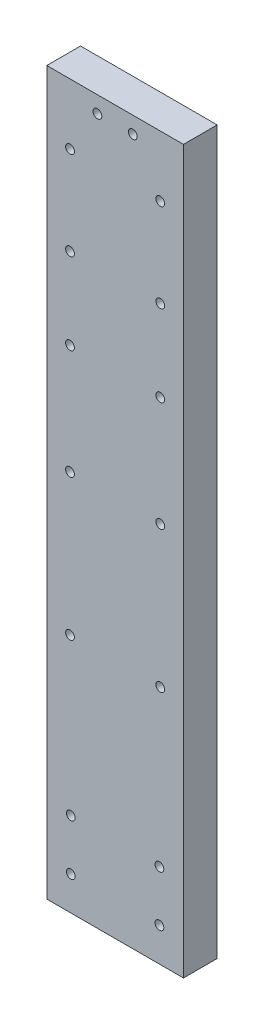
ISO-10303-21;
HEADER;
FILE_DESCRIPTION(('STEP AP214'),'2;1');
FILE_NAME('part.step','',(''),(''),'','','');
FILE_SCHEMA(('AUTOMOTIVE_DESIGN { 1 0 10303 214 1 1 1 1 }'));
ENDSEC;
DATA;
#1=APPLICATION_CONTEXT('core data for automotive mechanical design processes');
#2=APPLICATION_PROTOCOL_DEFINITION('international standard','automotive_design',2000,#1);
#3=PRODUCT_CONTEXT('',#1,'mechanical');
#4=PRODUCT('Part','Part','',(#3));
#5=PRODUCT_RELATED_PRODUCT_CATEGORY('part','',(#4));
#6=PRODUCT_DEFINITION_FORMATION('','',#4);
#7=PRODUCT_DEFINITION_CONTEXT('part definition',#1,'design');
#8=PRODUCT_DEFINITION('design','',#6,#7);
#9=PRODUCT_DEFINITION_SHAPE('','',#8);
#10=(LENGTH_UNIT() NAMED_UNIT(*) SI_UNIT(.MILLI.,.METRE.));
#11=(NAMED_UNIT(*) PLANE_ANGLE_UNIT() SI_UNIT($,.RADIAN.));
#12=(NAMED_UNIT(*) SI_UNIT($,.STERADIAN.) SOLID_ANGLE_UNIT());
#13=UNCERTAINTY_MEASURE_WITH_UNIT(LENGTH_MEASURE(1.E-05),#10,'distance_accuracy_value','');
#14=(GEOMETRIC_REPRESENTATION_CONTEXT(3) GLOBAL_UNCERTAINTY_ASSIGNED_CONTEXT((#13)) GLOBAL_UNIT_ASSIGNED_CONTEXT((#10,
#11,#12)) REPRESENTATION_CONTEXT('',''));
#15=CARTESIAN_POINT('',(0.,0.,0.));
#16=DIRECTION('',(0.,0.,1.));
#17=DIRECTION('',(1.,0.,0.));
#18=AXIS2_PLACEMENT_3D('',#15,#16,#17);
#19=CARTESIAN_POINT('',(0.,0.,4.));
#20=DIRECTION('',(0.,0.,-1.));
#21=DIRECTION('',(-1.,0.,0.));
#22=AXIS2_PLACEMENT_3D('',#19,#20,#21);
#23=PLANE('',#22);
#24=CARTESIAN_POINT('',(10.2,83.635,4.));
#25=DIRECTION('',(0.,0.,1.));
#26=DIRECTION('',(1.,0.,0.));
#27=AXIS2_PLACEMENT_3D('',#24,#25,#26);
#28=CIRCLE('',#27,0.519960121099865);
#29=CARTESIAN_POINT('',(10.7199601210999,83.635,4.));
#30=VERTEX_POINT('',#29);
#31=EDGE_CURVE('E193',#30,#30,#28,.T.);
#32=ORIENTED_EDGE('',*,*,#31,.F.);
#33=EDGE_LOOP('',(#32));
#34=FACE_BOUND('',#33,.T.);
#35=CARTESIAN_POINT('',(13.45,78.385,4.));
#36=DIRECTION('',(0.,0.,1.));
#37=DIRECTION('',(1.,0.,0.));
#38=AXIS2_PLACEMENT_3D('',#35,#36,#37);
#39=CIRCLE('',#38,0.519960121099864);
#40=CARTESIAN_POINT('',(13.9699601210999,78.385,4.));
#41=VERTEX_POINT('',#40);
#42=EDGE_CURVE('E181',#41,#41,#39,.T.);
#43=ORIENTED_EDGE('',*,*,#42,.F.);
#44=EDGE_LOOP('',(#43));
#45=FACE_BOUND('',#44,.T.);
#46=CARTESIAN_POINT('',(13.35,4.,4.));
#47=DIRECTION('',(0.,0.,1.));
#48=DIRECTION('',(-1.,0.,0.));
#49=AXIS2_PLACEMENT_3D('',#46,#47,#48);
#50=CIRCLE('',#49,0.519960121099866);
#51=CARTESIAN_POINT('',(12.8300398789001,4.,4.));
#52=VERTEX_POINT('',#51);
#53=EDGE_CURVE('E169',#52,#52,#50,.T.);
#54=ORIENTED_EDGE('',*,*,#53,.F.);
#55=EDGE_LOOP('',(#54));
#56=FACE_BOUND('',#55,.T.);
#57=CARTESIAN_POINT('',(2.85,4.,4.));
#58=DIRECTION('',(0.,0.,1.));
#59=DIRECTION('',(1.,0.,0.));
#60=AXIS2_PLACEMENT_3D('',#57,#58,#59);
#61=CIRCLE('',#60,0.519960121099866);
#62=CARTESIAN_POINT('',(3.36996012109987,4.,4.));
#63=VERTEX_POINT('',#62);
#64=EDGE_CURVE('E157',#63,#63,#61,.T.);
#65=ORIENTED_EDGE('',*,*,#64,.F.);
#66=EDGE_LOOP('',(#65));
#67=FACE_BOUND('',#66,.T.);
#68=CARTESIAN_POINT('',(13.45,67.885,4.));
#69=DIRECTION('',(0.,0.,1.));
#70=DIRECTION('',(1.,0.,0.));
#71=AXIS2_PLACEMENT_3D('',#68,#69,#70);
#72=CIRCLE('',#71,0.519960121099864);
#73=CARTESIAN_POINT('',(13.9699601210999,67.885,4.));
#74=VERTEX_POINT('',#73);
#75=EDGE_CURVE('E145',#74,#74,#72,.T.);
#76=ORIENTED_EDGE('',*,*,#75,.F.);
#77=EDGE_LOOP('',(#76));
#78=FACE_BOUND('',#77,.T.);
#79=CARTESIAN_POINT('',(13.45,58.24,4.));
#80=DIRECTION('',(0.,0.,1.));
#81=DIRECTION('',(1.,0.,0.));
#82=AXIS2_PLACEMENT_3D('',#79,#80,#81);
#83=CIRCLE('',#82,0.519960121099861);
#84=CARTESIAN_POINT('',(13.9699601210999,58.24,4.));
#85=VERTEX_POINT('',#84);
#86=EDGE_CURVE('E133',#85,#85,#83,.T.);
#87=ORIENTED_EDGE('',*,*,#86,.F.);
#88=EDGE_LOOP('',(#87));
#89=FACE_BOUND('',#88,.T.);
#90=CARTESIAN_POINT('',(13.45,45.24,4.));
#91=DIRECTION('',(0.,0.,1.));
#92=DIRECTION('',(1.,0.,0.));
#93=AXIS2_PLACEMENT_3D('',#90,#91,#92);
#94=CIRCLE('',#93,0.519960121099861);
#95=CARTESIAN_POINT('',(13.9699601210999,45.24,4.));
#96=VERTEX_POINT('',#95);
#97=EDGE_CURVE('E121',#96,#96,#94,.T.);
#98=ORIENTED_EDGE('',*,*,#97,.F.);
#99=EDGE_LOOP('',(#98));
#100=FACE_BOUND('',#99,.T.);
#101=CARTESIAN_POINT('',(13.45,28.5,4.));
#102=DIRECTION('',(0.,0.,1.));
#103=DIRECTION('',(1.,0.,0.));
#104=AXIS2_PLACEMENT_3D('',#101,#102,#103);
#105=CIRCLE('',#104,0.519960121099865);
#106=CARTESIAN_POINT('',(13.9699601210999,28.5,4.));
#107=VERTEX_POINT('',#106);
#108=EDGE_CURVE('E100',#107,#107,#105,.T.);
#109=ORIENTED_EDGE('',*,*,#108,.F.);
#110=EDGE_LOOP('',(#109));
#111=FACE_BOUND('',#110,.T.);
#112=DIRECTION('',(-1.,0.,0.));
#113=VECTOR('',#112,1.);
#114=CARTESIAN_POINT('',(16.2,85.59,4.));
#115=LINE('',#114,#113);
#116=CARTESIAN_POINT('',(16.2,85.59,4.));
#117=VERTEX_POINT('',#116);
#118=CARTESIAN_POINT('',(0.,85.59,4.));
#119=VERTEX_POINT('',#118);
#120=EDGE_CURVE('E85',#117,#119,#115,.T.);
#121=ORIENTED_EDGE('',*,*,#120,.T.);
#122=DIRECTION('',(0.,-1.,0.));
#123=VECTOR('',#122,1.);
#124=CARTESIAN_POINT('',(0.,0.,4.));
#125=LINE('',#124,#123);
#126=CARTESIAN_POINT('',(0.,0.,4.));
#127=VERTEX_POINT('',#126);
#128=EDGE_CURVE('E80',#119,#127,#125,.T.);
#129=ORIENTED_EDGE('',*,*,#128,.T.);
#130=DIRECTION('',(1.,0.,0.));
#131=VECTOR('',#130,1.);
#132=CARTESIAN_POINT('',(0.,0.,4.));
#133=LINE('',#132,#131);
#134=CARTESIAN_POINT('',(16.2,0.,4.));
#135=VERTEX_POINT('',#134);
#136=EDGE_CURVE('E83',#127,#135,#133,.T.);
#137=ORIENTED_EDGE('',*,*,#136,.T.);
#138=DIRECTION('',(0.,1.,0.));
#139=VECTOR('',#138,1.);
#140=CARTESIAN_POINT('',(16.2,0.,4.));
#141=LINE('',#140,#139);
#142=EDGE_CURVE('E50',#135,#117,#141,.T.);
#143=ORIENTED_EDGE('',*,*,#142,.T.);
#144=EDGE_LOOP('',(#121,#129,#137,#143));
#145=FACE_BOUND('',#144,.T.);
#146=CARTESIAN_POINT('',(2.75,28.5,4.));
#147=DIRECTION('',(0.,0.,1.));
#148=DIRECTION('',(1.,0.,0.));
#149=AXIS2_PLACEMENT_3D('',#146,#147,#148);
#150=CIRCLE('',#149,0.519960121099867);
#151=CARTESIAN_POINT('',(3.26996012109987,28.5,4.));
#152=VERTEX_POINT('',#151);
#153=EDGE_CURVE('E115',#152,#152,#150,.T.);
#154=ORIENTED_EDGE('',*,*,#153,.F.);
#155=EDGE_LOOP('',(#154));
#156=FACE_BOUND('',#155,.T.);
#157=CARTESIAN_POINT('',(2.75,45.24,4.));
#158=DIRECTION('',(0.,0.,1.));
#159=DIRECTION('',(1.,0.,0.));
#160=AXIS2_PLACEMENT_3D('',#157,#158,#159);
#161=CIRCLE('',#160,0.519960121099859);
#162=CARTESIAN_POINT('',(3.26996012109986,45.24,4.));
#163=VERTEX_POINT('',#162);
#164=EDGE_CURVE('E127',#163,#163,#161,.T.);
#165=ORIENTED_EDGE('',*,*,#164,.F.);
#166=EDGE_LOOP('',(#165));
#167=FACE_BOUND('',#166,.T.);
#168=CARTESIAN_POINT('',(2.75,58.24,4.));
#169=DIRECTION('',(0.,0.,1.));
#170=DIRECTION('',(1.,0.,0.));
#171=AXIS2_PLACEMENT_3D('',#168,#169,#170);
#172=CIRCLE('',#171,0.51996012109986);
#173=CARTESIAN_POINT('',(3.26996012109986,58.24,4.));
#174=VERTEX_POINT('',#173);
#175=EDGE_CURVE('E139',#174,#174,#172,.T.);
#176=ORIENTED_EDGE('',*,*,#175,.F.);
#177=EDGE_LOOP('',(#176));
#178=FACE_BOUND('',#177,.T.);
#179=CARTESIAN_POINT('',(2.85,10.,4.));
#180=DIRECTION('',(0.,0.,1.));
#181=DIRECTION('',(1.,0.,0.));
#182=AXIS2_PLACEMENT_3D('',#179,#180,#181);
#183=CIRCLE('',#182,0.519960121099866);
#184=CARTESIAN_POINT('',(3.36996012109986,10.,4.));
#185=VERTEX_POINT('',#184);
#186=EDGE_CURVE('E151',#185,#185,#183,.T.);
#187=ORIENTED_EDGE('',*,*,#186,.F.);
#188=EDGE_LOOP('',(#187));
#189=FACE_BOUND('',#188,.T.);
#190=CARTESIAN_POINT('',(13.35,10.,4.));
#191=DIRECTION('',(0.,0.,1.));
#192=DIRECTION('',(-1.,0.,0.));
#193=AXIS2_PLACEMENT_3D('',#190,#191,#192);
#194=CIRCLE('',#193,0.519960121099863);
#195=CARTESIAN_POINT('',(12.8300398789001,10.,4.));
#196=VERTEX_POINT('',#195);
#197=EDGE_CURVE('E163',#196,#196,#194,.T.);
#198=ORIENTED_EDGE('',*,*,#197,.F.);
#199=EDGE_LOOP('',(#198));
#200=FACE_BOUND('',#199,.T.);
#201=CARTESIAN_POINT('',(2.74999999999862,67.885,4.));
#202=DIRECTION('',(0.,0.,1.));
#203=DIRECTION('',(1.,0.,0.));
#204=AXIS2_PLACEMENT_3D('',#201,#202,#203);
#205=CIRCLE('',#204,0.519960121099858);
#206=CARTESIAN_POINT('',(3.26996012109847,67.885,4.));
#207=VERTEX_POINT('',#206);
#208=EDGE_CURVE('E175',#207,#207,#205,.T.);
#209=ORIENTED_EDGE('',*,*,#208,.F.);
#210=EDGE_LOOP('',(#209));
#211=FACE_BOUND('',#210,.T.);
#212=CARTESIAN_POINT('',(2.74999999999862,78.385,4.));
#213=DIRECTION('',(0.,0.,1.));
#214=DIRECTION('',(1.,0.,0.));
#215=AXIS2_PLACEMENT_3D('',#212,#213,#214);
#216=CIRCLE('',#215,0.51996012109986);
#217=CARTESIAN_POINT('',(3.26996012109848,78.385,4.));
#218=VERTEX_POINT('',#217);
#219=EDGE_CURVE('E187',#218,#218,#216,.T.);
#220=ORIENTED_EDGE('',*,*,#219,.F.);
#221=EDGE_LOOP('',(#220));
#222=FACE_BOUND('',#221,.T.);
#223=CARTESIAN_POINT('',(6.,83.635,4.));
#224=DIRECTION('',(0.,0.,1.));
#225=DIRECTION('',(1.,0.,0.));
#226=AXIS2_PLACEMENT_3D('',#223,#224,#225);
#227=CIRCLE('',#226,0.519960121099862);
#228=CARTESIAN_POINT('',(6.51996012109986,83.635,4.));
#229=VERTEX_POINT('',#228);
#230=EDGE_CURVE('E199',#229,#229,#227,.T.);
#231=ORIENTED_EDGE('',*,*,#230,.F.);
#232=EDGE_LOOP('',(#231));
#233=FACE_BOUND('',#232,.T.);
#234=ADVANCED_FACE('F33',(#34,#45,#56,#67,#78,#89,#100,#111,#145,#156,#167,#178,#189,#200,#211,
#222,#233),#23,.F.);
#235=CARTESIAN_POINT('',(0.,0.,0.));
#236=DIRECTION('',(0.,0.,-1.));
#237=DIRECTION('',(-1.,0.,0.));
#238=AXIS2_PLACEMENT_3D('',#235,#236,#237);
#239=PLANE('',#238);
#240=CARTESIAN_POINT('',(10.2,83.635,0.));
#241=DIRECTION('',(0.,0.,1.));
#242=DIRECTION('',(1.,0.,0.));
#243=AXIS2_PLACEMENT_3D('',#240,#241,#242);
#244=CIRCLE('',#243,0.519960121099865);
#245=CARTESIAN_POINT('',(10.7199601210999,83.635,0.));
#246=VERTEX_POINT('',#245);
#247=EDGE_CURVE('E196',#246,#246,#244,.T.);
#248=ORIENTED_EDGE('',*,*,#247,.T.);
#249=EDGE_LOOP('',(#248));
#250=FACE_BOUND('',#249,.T.);
#251=CARTESIAN_POINT('',(13.45,78.385,0.));
#252=DIRECTION('',(0.,0.,1.));
#253=DIRECTION('',(1.,0.,0.));
#254=AXIS2_PLACEMENT_3D('',#251,#252,#253);
#255=CIRCLE('',#254,0.519960121099864);
#256=CARTESIAN_POINT('',(13.9699601210999,78.385,0.));
#257=VERTEX_POINT('',#256);
#258=EDGE_CURVE('E184',#257,#257,#255,.T.);
#259=ORIENTED_EDGE('',*,*,#258,.T.);
#260=EDGE_LOOP('',(#259));
#261=FACE_BOUND('',#260,.T.);
#262=CARTESIAN_POINT('',(13.35,4.,0.));
#263=DIRECTION('',(0.,0.,1.));
#264=DIRECTION('',(-1.,0.,0.));
#265=AXIS2_PLACEMENT_3D('',#262,#263,#264);
#266=CIRCLE('',#265,0.519960121099866);
#267=CARTESIAN_POINT('',(12.8300398789001,4.,0.));
#268=VERTEX_POINT('',#267);
#269=EDGE_CURVE('E172',#268,#268,#266,.T.);
#270=ORIENTED_EDGE('',*,*,#269,.T.);
#271=EDGE_LOOP('',(#270));
#272=FACE_BOUND('',#271,.T.);
#273=CARTESIAN_POINT('',(2.85,4.,0.));
#274=DIRECTION('',(0.,0.,1.));
#275=DIRECTION('',(1.,0.,0.));
#276=AXIS2_PLACEMENT_3D('',#273,#274,#275);
#277=CIRCLE('',#276,0.519960121099866);
#278=CARTESIAN_POINT('',(3.36996012109987,4.,0.));
#279=VERTEX_POINT('',#278);
#280=EDGE_CURVE('E160',#279,#279,#277,.T.);
#281=ORIENTED_EDGE('',*,*,#280,.T.);
#282=EDGE_LOOP('',(#281));
#283=FACE_BOUND('',#282,.T.);
#284=CARTESIAN_POINT('',(13.45,67.885,0.));
#285=DIRECTION('',(0.,0.,1.));
#286=DIRECTION('',(1.,0.,0.));
#287=AXIS2_PLACEMENT_3D('',#284,#285,#286);
#288=CIRCLE('',#287,0.519960121099864);
#289=CARTESIAN_POINT('',(13.9699601210999,67.885,0.));
#290=VERTEX_POINT('',#289);
#291=EDGE_CURVE('E148',#290,#290,#288,.T.);
#292=ORIENTED_EDGE('',*,*,#291,.T.);
#293=EDGE_LOOP('',(#292));
#294=FACE_BOUND('',#293,.T.);
#295=CARTESIAN_POINT('',(13.45,58.24,0.));
#296=DIRECTION('',(0.,0.,1.));
#297=DIRECTION('',(1.,0.,0.));
#298=AXIS2_PLACEMENT_3D('',#295,#296,#297);
#299=CIRCLE('',#298,0.519960121099861);
#300=CARTESIAN_POINT('',(13.9699601210999,58.24,0.));
#301=VERTEX_POINT('',#300);
#302=EDGE_CURVE('E136',#301,#301,#299,.T.);
#303=ORIENTED_EDGE('',*,*,#302,.T.);
#304=EDGE_LOOP('',(#303));
#305=FACE_BOUND('',#304,.T.);
#306=CARTESIAN_POINT('',(13.45,45.24,0.));
#307=DIRECTION('',(0.,0.,1.));
#308=DIRECTION('',(1.,0.,0.));
#309=AXIS2_PLACEMENT_3D('',#306,#307,#308);
#310=CIRCLE('',#309,0.519960121099861);
#311=CARTESIAN_POINT('',(13.9699601210999,45.24,0.));
#312=VERTEX_POINT('',#311);
#313=EDGE_CURVE('E124',#312,#312,#310,.T.);
#314=ORIENTED_EDGE('',*,*,#313,.T.);
#315=EDGE_LOOP('',(#314));
#316=FACE_BOUND('',#315,.T.);
#317=CARTESIAN_POINT('',(13.45,28.5,0.));
#318=DIRECTION('',(0.,0.,1.));
#319=DIRECTION('',(1.,0.,0.));
#320=AXIS2_PLACEMENT_3D('',#317,#318,#319);
#321=CIRCLE('',#320,0.519960121099865);
#322=CARTESIAN_POINT('',(13.9699601210999,28.5,0.));
#323=VERTEX_POINT('',#322);
#324=EDGE_CURVE('E112',#323,#323,#321,.T.);
#325=ORIENTED_EDGE('',*,*,#324,.T.);
#326=EDGE_LOOP('',(#325));
#327=FACE_BOUND('',#326,.T.);
#328=DIRECTION('',(-1.,0.,0.));
#329=VECTOR('',#328,1.);
#330=CARTESIAN_POINT('',(16.2,85.59,0.));
#331=LINE('',#330,#329);
#332=CARTESIAN_POINT('',(16.2,85.59,0.));
#333=VERTEX_POINT('',#332);
#334=CARTESIAN_POINT('',(0.,85.59,0.));
#335=VERTEX_POINT('',#334);
#336=EDGE_CURVE('E97',#333,#335,#331,.T.);
#337=ORIENTED_EDGE('',*,*,#336,.F.);
#338=DIRECTION('',(0.,1.,0.));
#339=VECTOR('',#338,1.);
#340=CARTESIAN_POINT('',(16.2,0.,0.));
#341=LINE('',#340,#339);
#342=CARTESIAN_POINT('',(16.2,0.,0.));
#343=VERTEX_POINT('',#342);
#344=EDGE_CURVE('E73',#343,#333,#341,.T.);
#345=ORIENTED_EDGE('',*,*,#344,.F.);
#346=DIRECTION('',(1.,0.,0.));
#347=VECTOR('',#346,1.);
#348=CARTESIAN_POINT('',(0.,0.,0.));
#349=LINE('',#348,#347);
#350=CARTESIAN_POINT('',(0.,0.,0.));
#351=VERTEX_POINT('',#350);
#352=EDGE_CURVE('E67',#351,#343,#349,.T.);
#353=ORIENTED_EDGE('',*,*,#352,.F.);
#354=DIRECTION('',(0.,-1.,0.));
#355=VECTOR('',#354,1.);
#356=CARTESIAN_POINT('',(0.,0.,0.));
#357=LINE('',#356,#355);
#358=EDGE_CURVE('E89',#335,#351,#357,.T.);
#359=ORIENTED_EDGE('',*,*,#358,.F.);
#360=EDGE_LOOP('',(#337,#345,#353,#359));
#361=FACE_BOUND('',#360,.T.);
#362=CARTESIAN_POINT('',(2.75,28.5,0.));
#363=DIRECTION('',(0.,0.,1.));
#364=DIRECTION('',(1.,0.,0.));
#365=AXIS2_PLACEMENT_3D('',#362,#363,#364);
#366=CIRCLE('',#365,0.519960121099867);
#367=CARTESIAN_POINT('',(3.26996012109987,28.5,0.));
#368=VERTEX_POINT('',#367);
#369=EDGE_CURVE('E118',#368,#368,#366,.T.);
#370=ORIENTED_EDGE('',*,*,#369,.T.);
#371=EDGE_LOOP('',(#370));
#372=FACE_BOUND('',#371,.T.);
#373=CARTESIAN_POINT('',(2.75,45.24,0.));
#374=DIRECTION('',(0.,0.,1.));
#375=DIRECTION('',(1.,0.,0.));
#376=AXIS2_PLACEMENT_3D('',#373,#374,#375);
#377=CIRCLE('',#376,0.519960121099859);
#378=CARTESIAN_POINT('',(3.26996012109986,45.24,0.));
#379=VERTEX_POINT('',#378);
#380=EDGE_CURVE('E130',#379,#379,#377,.T.);
#381=ORIENTED_EDGE('',*,*,#380,.T.);
#382=EDGE_LOOP('',(#381));
#383=FACE_BOUND('',#382,.T.);
#384=CARTESIAN_POINT('',(2.75,58.24,0.));
#385=DIRECTION('',(0.,0.,1.));
#386=DIRECTION('',(1.,0.,0.));
#387=AXIS2_PLACEMENT_3D('',#384,#385,#386);
#388=CIRCLE('',#387,0.51996012109986);
#389=CARTESIAN_POINT('',(3.26996012109986,58.24,0.));
#390=VERTEX_POINT('',#389);
#391=EDGE_CURVE('E142',#390,#390,#388,.T.);
#392=ORIENTED_EDGE('',*,*,#391,.T.);
#393=EDGE_LOOP('',(#392));
#394=FACE_BOUND('',#393,.T.);
#395=CARTESIAN_POINT('',(2.85,10.,0.));
#396=DIRECTION('',(0.,0.,1.));
#397=DIRECTION('',(1.,0.,0.));
#398=AXIS2_PLACEMENT_3D('',#395,#396,#397);
#399=CIRCLE('',#398,0.519960121099866);
#400=CARTESIAN_POINT('',(3.36996012109986,10.,0.));
#401=VERTEX_POINT('',#400);
#402=EDGE_CURVE('E154',#401,#401,#399,.T.);
#403=ORIENTED_EDGE('',*,*,#402,.T.);
#404=EDGE_LOOP('',(#403));
#405=FACE_BOUND('',#404,.T.);
#406=CARTESIAN_POINT('',(13.35,10.,0.));
#407=DIRECTION('',(0.,0.,1.));
#408=DIRECTION('',(-1.,0.,0.));
#409=AXIS2_PLACEMENT_3D('',#406,#407,#408);
#410=CIRCLE('',#409,0.519960121099863);
#411=CARTESIAN_POINT('',(12.8300398789001,10.,0.));
#412=VERTEX_POINT('',#411);
#413=EDGE_CURVE('E166',#412,#412,#410,.T.);
#414=ORIENTED_EDGE('',*,*,#413,.T.);
#415=EDGE_LOOP('',(#414));
#416=FACE_BOUND('',#415,.T.);
#417=CARTESIAN_POINT('',(2.74999999999862,67.885,0.));
#418=DIRECTION('',(0.,0.,1.));
#419=DIRECTION('',(1.,0.,0.));
#420=AXIS2_PLACEMENT_3D('',#417,#418,#419);
#421=CIRCLE('',#420,0.519960121099858);
#422=CARTESIAN_POINT('',(3.26996012109847,67.885,0.));
#423=VERTEX_POINT('',#422);
#424=EDGE_CURVE('E178',#423,#423,#421,.T.);
#425=ORIENTED_EDGE('',*,*,#424,.T.);
#426=EDGE_LOOP('',(#425));
#427=FACE_BOUND('',#426,.T.);
#428=CARTESIAN_POINT('',(2.74999999999862,78.385,0.));
#429=DIRECTION('',(0.,0.,1.));
#430=DIRECTION('',(1.,0.,0.));
#431=AXIS2_PLACEMENT_3D('',#428,#429,#430);
#432=CIRCLE('',#431,0.51996012109986);
#433=CARTESIAN_POINT('',(3.26996012109848,78.385,0.));
#434=VERTEX_POINT('',#433);
#435=EDGE_CURVE('E190',#434,#434,#432,.T.);
#436=ORIENTED_EDGE('',*,*,#435,.T.);
#437=EDGE_LOOP('',(#436));
#438=FACE_BOUND('',#437,.T.);
#439=CARTESIAN_POINT('',(6.,83.635,0.));
#440=DIRECTION('',(0.,0.,1.));
#441=DIRECTION('',(1.,0.,0.));
#442=AXIS2_PLACEMENT_3D('',#439,#440,#441);
#443=CIRCLE('',#442,0.519960121099862);
#444=CARTESIAN_POINT('',(6.51996012109986,83.635,0.));
#445=VERTEX_POINT('',#444);
#446=EDGE_CURVE('E202',#445,#445,#443,.T.);
#447=ORIENTED_EDGE('',*,*,#446,.T.);
#448=EDGE_LOOP('',(#447));
#449=FACE_BOUND('',#448,.T.);
#450=ADVANCED_FACE('F108',(#250,#261,#272,#283,#294,#305,#316,#327,#361,#372,#383,#394,#405,
#416,#427,#438,#449),#239,.T.);
#451=CARTESIAN_POINT('',(16.2,85.59,4.));
#452=DIRECTION('',(0.,-1.,0.));
#453=DIRECTION('',(0.,0.,-1.));
#454=AXIS2_PLACEMENT_3D('',#451,#452,#453);
#455=PLANE('',#454);
#456=ORIENTED_EDGE('',*,*,#336,.T.);
#457=DIRECTION('',(0.,0.,-1.));
#458=VECTOR('',#457,1.);
#459=CARTESIAN_POINT('',(0.,85.59,4.));
#460=LINE('',#459,#458);
#461=EDGE_CURVE('E11',#119,#335,#460,.T.);
#462=ORIENTED_EDGE('',*,*,#461,.F.);
#463=ORIENTED_EDGE('',*,*,#120,.F.);
#464=DIRECTION('',(0.,0.,-1.));
#465=VECTOR('',#464,1.);
#466=CARTESIAN_POINT('',(16.2,85.59,4.));
#467=LINE('',#466,#465);
#468=EDGE_CURVE('E93',#117,#333,#467,.T.);
#469=ORIENTED_EDGE('',*,*,#468,.T.);
#470=EDGE_LOOP('',(#456,#462,#463,#469));
#471=FACE_BOUND('',#470,.T.);
#472=ADVANCED_FACE('F35',(#471),#455,.F.);
#473=CARTESIAN_POINT('',(0.,0.,4.));
#474=DIRECTION('',(1.,0.,0.));
#475=DIRECTION('',(0.,0.,-1.));
#476=AXIS2_PLACEMENT_3D('',#473,#474,#475);
#477=PLANE('',#476);
#478=ORIENTED_EDGE('',*,*,#358,.T.);
#479=DIRECTION('',(0.,0.,-1.));
#480=VECTOR('',#479,1.);
#481=CARTESIAN_POINT('',(0.,0.,4.));
#482=LINE('',#481,#480);
#483=EDGE_CURVE('E42',#127,#351,#482,.T.);
#484=ORIENTED_EDGE('',*,*,#483,.F.);
#485=ORIENTED_EDGE('',*,*,#128,.F.);
#486=ORIENTED_EDGE('',*,*,#461,.T.);
#487=EDGE_LOOP('',(#478,#484,#485,#486));
#488=FACE_BOUND('',#487,.T.);
#489=ADVANCED_FACE('F88',(#488),#477,.F.);
#490=CARTESIAN_POINT('',(0.,0.,4.));
#491=DIRECTION('',(0.,1.,0.));
#492=DIRECTION('',(0.,0.,1.));
#493=AXIS2_PLACEMENT_3D('',#490,#491,#492);
#494=PLANE('',#493);
#495=ORIENTED_EDGE('',*,*,#352,.T.);
#496=DIRECTION('',(0.,0.,-1.));
#497=VECTOR('',#496,1.);
#498=CARTESIAN_POINT('',(16.2,0.,4.));
#499=LINE('',#498,#497);
#500=EDGE_CURVE('E90',#135,#343,#499,.T.);
#501=ORIENTED_EDGE('',*,*,#500,.F.);
#502=ORIENTED_EDGE('',*,*,#136,.F.);
#503=ORIENTED_EDGE('',*,*,#483,.T.);
#504=EDGE_LOOP('',(#495,#501,#502,#503));
#505=FACE_BOUND('',#504,.T.);
#506=ADVANCED_FACE('F91',(#505),#494,.F.);
#507=CARTESIAN_POINT('',(16.2,0.,4.));
#508=DIRECTION('',(-1.,0.,0.));
#509=DIRECTION('',(0.,0.,1.));
#510=AXIS2_PLACEMENT_3D('',#507,#508,#509);
#511=PLANE('',#510);
#512=ORIENTED_EDGE('',*,*,#344,.T.);
#513=ORIENTED_EDGE('',*,*,#468,.F.);
#514=ORIENTED_EDGE('',*,*,#142,.F.);
#515=ORIENTED_EDGE('',*,*,#500,.T.);
#516=EDGE_LOOP('',(#512,#513,#514,#515));
#517=FACE_BOUND('',#516,.T.);
#518=ADVANCED_FACE('F105',(#517),#511,.F.);
#519=CARTESIAN_POINT('',(13.45,28.5,4.));
#520=DIRECTION('',(0.,0.,-1.));
#521=DIRECTION('',(-1.,0.,0.));
#522=AXIS2_PLACEMENT_3D('',#519,#520,#521);
#523=CYLINDRICAL_SURFACE('',#522,0.519960121099865);
#524=ORIENTED_EDGE('',*,*,#108,.T.);
#525=EDGE_LOOP('',(#524));
#526=FACE_BOUND('',#525,.T.);
#527=ORIENTED_EDGE('',*,*,#324,.F.);
#528=EDGE_LOOP('',(#527));
#529=FACE_BOUND('',#528,.T.);
#530=ADVANCED_FACE('F222',(#526,#529),#523,.F.);
#531=CARTESIAN_POINT('',(2.75,28.5,4.));
#532=DIRECTION('',(0.,0.,-1.));
#533=DIRECTION('',(-1.,0.,0.));
#534=AXIS2_PLACEMENT_3D('',#531,#532,#533);
#535=CYLINDRICAL_SURFACE('',#534,0.519960121099867);
#536=ORIENTED_EDGE('',*,*,#153,.T.);
#537=EDGE_LOOP('',(#536));
#538=FACE_BOUND('',#537,.T.);
#539=ORIENTED_EDGE('',*,*,#369,.F.);
#540=EDGE_LOOP('',(#539));
#541=FACE_BOUND('',#540,.T.);
#542=ADVANCED_FACE('F268',(#538,#541),#535,.F.);
#543=CARTESIAN_POINT('',(13.45,45.24,4.));
#544=DIRECTION('',(0.,0.,-1.));
#545=DIRECTION('',(-1.,0.,0.));
#546=AXIS2_PLACEMENT_3D('',#543,#544,#545);
#547=CYLINDRICAL_SURFACE('',#546,0.519960121099861);
#548=ORIENTED_EDGE('',*,*,#97,.T.);
#549=EDGE_LOOP('',(#548));
#550=FACE_BOUND('',#549,.T.);
#551=ORIENTED_EDGE('',*,*,#313,.F.);
#552=EDGE_LOOP('',(#551));
#553=FACE_BOUND('',#552,.T.);
#554=ADVANCED_FACE('F276',(#550,#553),#547,.F.);
#555=CARTESIAN_POINT('',(2.75,45.24,4.));
#556=DIRECTION('',(0.,0.,-1.));
#557=DIRECTION('',(-1.,0.,0.));
#558=AXIS2_PLACEMENT_3D('',#555,#556,#557);
#559=CYLINDRICAL_SURFACE('',#558,0.519960121099859);
#560=ORIENTED_EDGE('',*,*,#164,.T.);
#561=EDGE_LOOP('',(#560));
#562=FACE_BOUND('',#561,.T.);
#563=ORIENTED_EDGE('',*,*,#380,.F.);
#564=EDGE_LOOP('',(#563));
#565=FACE_BOUND('',#564,.T.);
#566=ADVANCED_FACE('F284',(#562,#565),#559,.F.);
#567=CARTESIAN_POINT('',(13.45,58.24,4.));
#568=DIRECTION('',(0.,0.,-1.));
#569=DIRECTION('',(-1.,0.,0.));
#570=AXIS2_PLACEMENT_3D('',#567,#568,#569);
#571=CYLINDRICAL_SURFACE('',#570,0.519960121099861);
#572=ORIENTED_EDGE('',*,*,#86,.T.);
#573=EDGE_LOOP('',(#572));
#574=FACE_BOUND('',#573,.T.);
#575=ORIENTED_EDGE('',*,*,#302,.F.);
#576=EDGE_LOOP('',(#575));
#577=FACE_BOUND('',#576,.T.);
#578=ADVANCED_FACE('F293',(#574,#577),#571,.F.);
#579=CARTESIAN_POINT('',(2.75,58.24,4.));
#580=DIRECTION('',(0.,0.,-1.));
#581=DIRECTION('',(-1.,0.,0.));
#582=AXIS2_PLACEMENT_3D('',#579,#580,#581);
#583=CYLINDRICAL_SURFACE('',#582,0.51996012109986);
#584=ORIENTED_EDGE('',*,*,#175,.T.);
#585=EDGE_LOOP('',(#584));
#586=FACE_BOUND('',#585,.T.);
#587=ORIENTED_EDGE('',*,*,#391,.F.);
#588=EDGE_LOOP('',(#587));
#589=FACE_BOUND('',#588,.T.);
#590=ADVANCED_FACE('F302',(#586,#589),#583,.F.);
#591=CARTESIAN_POINT('',(13.45,67.885,4.));
#592=DIRECTION('',(0.,0.,-1.));
#593=DIRECTION('',(-1.,0.,0.));
#594=AXIS2_PLACEMENT_3D('',#591,#592,#593);
#595=CYLINDRICAL_SURFACE('',#594,0.519960121099864);
#596=ORIENTED_EDGE('',*,*,#75,.T.);
#597=EDGE_LOOP('',(#596));
#598=FACE_BOUND('',#597,.T.);
#599=ORIENTED_EDGE('',*,*,#291,.F.);
#600=EDGE_LOOP('',(#599));
#601=FACE_BOUND('',#600,.T.);
#602=ADVANCED_FACE('F311',(#598,#601),#595,.F.);
#603=CARTESIAN_POINT('',(2.85,10.,4.));
#604=DIRECTION('',(0.,0.,-1.));
#605=DIRECTION('',(-1.,0.,0.));
#606=AXIS2_PLACEMENT_3D('',#603,#604,#605);
#607=CYLINDRICAL_SURFACE('',#606,0.519960121099866);
#608=ORIENTED_EDGE('',*,*,#186,.T.);
#609=EDGE_LOOP('',(#608));
#610=FACE_BOUND('',#609,.T.);
#611=ORIENTED_EDGE('',*,*,#402,.F.);
#612=EDGE_LOOP('',(#611));
#613=FACE_BOUND('',#612,.T.);
#614=ADVANCED_FACE('F320',(#610,#613),#607,.F.);
#615=CARTESIAN_POINT('',(2.85,4.,4.));
#616=DIRECTION('',(0.,0.,-1.));
#617=DIRECTION('',(-1.,0.,0.));
#618=AXIS2_PLACEMENT_3D('',#615,#616,#617);
#619=CYLINDRICAL_SURFACE('',#618,0.519960121099866);
#620=ORIENTED_EDGE('',*,*,#64,.T.);
#621=EDGE_LOOP('',(#620));
#622=FACE_BOUND('',#621,.T.);
#623=ORIENTED_EDGE('',*,*,#280,.F.);
#624=EDGE_LOOP('',(#623));
#625=FACE_BOUND('',#624,.T.);
#626=ADVANCED_FACE('F329',(#622,#625),#619,.F.);
#627=CARTESIAN_POINT('',(13.35,10.,4.));
#628=DIRECTION('',(0.,0.,-1.));
#629=DIRECTION('',(-1.,0.,0.));
#630=AXIS2_PLACEMENT_3D('',#627,#628,#629);
#631=CYLINDRICAL_SURFACE('',#630,0.519960121099863);
#632=ORIENTED_EDGE('',*,*,#197,.T.);
#633=EDGE_LOOP('',(#632));
#634=FACE_BOUND('',#633,.T.);
#635=ORIENTED_EDGE('',*,*,#413,.F.);
#636=EDGE_LOOP('',(#635));
#637=FACE_BOUND('',#636,.T.);
#638=ADVANCED_FACE('F338',(#634,#637),#631,.F.);
#639=CARTESIAN_POINT('',(13.35,4.,4.));
#640=DIRECTION('',(0.,0.,-1.));
#641=DIRECTION('',(-1.,0.,0.));
#642=AXIS2_PLACEMENT_3D('',#639,#640,#641);
#643=CYLINDRICAL_SURFACE('',#642,0.519960121099866);
#644=ORIENTED_EDGE('',*,*,#53,.T.);
#645=EDGE_LOOP('',(#644));
#646=FACE_BOUND('',#645,.T.);
#647=ORIENTED_EDGE('',*,*,#269,.F.);
#648=EDGE_LOOP('',(#647));
#649=FACE_BOUND('',#648,.T.);
#650=ADVANCED_FACE('F347',(#646,#649),#643,.F.);
#651=CARTESIAN_POINT('',(2.74999999999862,67.885,4.));
#652=DIRECTION('',(0.,0.,-1.));
#653=DIRECTION('',(-1.,0.,0.));
#654=AXIS2_PLACEMENT_3D('',#651,#652,#653);
#655=CYLINDRICAL_SURFACE('',#654,0.519960121099858);
#656=ORIENTED_EDGE('',*,*,#208,.T.);
#657=EDGE_LOOP('',(#656));
#658=FACE_BOUND('',#657,.T.);
#659=ORIENTED_EDGE('',*,*,#424,.F.);
#660=EDGE_LOOP('',(#659));
#661=FACE_BOUND('',#660,.T.);
#662=ADVANCED_FACE('F356',(#658,#661),#655,.F.);
#663=CARTESIAN_POINT('',(13.45,78.385,4.));
#664=DIRECTION('',(0.,0.,-1.));
#665=DIRECTION('',(-1.,0.,0.));
#666=AXIS2_PLACEMENT_3D('',#663,#664,#665);
#667=CYLINDRICAL_SURFACE('',#666,0.519960121099864);
#668=ORIENTED_EDGE('',*,*,#42,.T.);
#669=EDGE_LOOP('',(#668));
#670=FACE_BOUND('',#669,.T.);
#671=ORIENTED_EDGE('',*,*,#258,.F.);
#672=EDGE_LOOP('',(#671));
#673=FACE_BOUND('',#672,.T.);
#674=ADVANCED_FACE('F365',(#670,#673),#667,.F.);
#675=CARTESIAN_POINT('',(2.74999999999862,78.385,4.));
#676=DIRECTION('',(0.,0.,-1.));
#677=DIRECTION('',(-1.,0.,0.));
#678=AXIS2_PLACEMENT_3D('',#675,#676,#677);
#679=CYLINDRICAL_SURFACE('',#678,0.51996012109986);
#680=ORIENTED_EDGE('',*,*,#219,.T.);
#681=EDGE_LOOP('',(#680));
#682=FACE_BOUND('',#681,.T.);
#683=ORIENTED_EDGE('',*,*,#435,.F.);
#684=EDGE_LOOP('',(#683));
#685=FACE_BOUND('',#684,.T.);
#686=ADVANCED_FACE('F374',(#682,#685),#679,.F.);
#687=CARTESIAN_POINT('',(10.2,83.635,4.));
#688=DIRECTION('',(0.,0.,-1.));
#689=DIRECTION('',(-1.,0.,0.));
#690=AXIS2_PLACEMENT_3D('',#687,#688,#689);
#691=CYLINDRICAL_SURFACE('',#690,0.519960121099865);
#692=ORIENTED_EDGE('',*,*,#31,.T.);
#693=EDGE_LOOP('',(#692));
#694=FACE_BOUND('',#693,.T.);
#695=ORIENTED_EDGE('',*,*,#247,.F.);
#696=EDGE_LOOP('',(#695));
#697=FACE_BOUND('',#696,.T.);
#698=ADVANCED_FACE('F383',(#694,#697),#691,.F.);
#699=CARTESIAN_POINT('',(6.,83.635,4.));
#700=DIRECTION('',(0.,0.,-1.));
#701=DIRECTION('',(-1.,0.,0.));
#702=AXIS2_PLACEMENT_3D('',#699,#700,#701);
#703=CYLINDRICAL_SURFACE('',#702,0.519960121099862);
#704=ORIENTED_EDGE('',*,*,#230,.T.);
#705=EDGE_LOOP('',(#704));
#706=FACE_BOUND('',#705,.T.);
#707=ORIENTED_EDGE('',*,*,#446,.F.);
#708=EDGE_LOOP('',(#707));
#709=FACE_BOUND('',#708,.T.);
#710=ADVANCED_FACE('F208',(#706,#709),#703,.F.);
#711=CLOSED_SHELL('',(#234,#450,#472,#489,#506,#518,#530,#542,#554,#566,#578,#590,#602,#614,
#626,#638,#650,#662,#674,#686,#698,#710));
#712=MANIFOLD_SOLID_BREP('B2',#711);
#713=ADVANCED_BREP_SHAPE_REPRESENTATION('',(#18,#712),#14);
#714=SHAPE_DEFINITION_REPRESENTATION(#9,#713);
ENDSEC;
END-ISO-10303-21;
